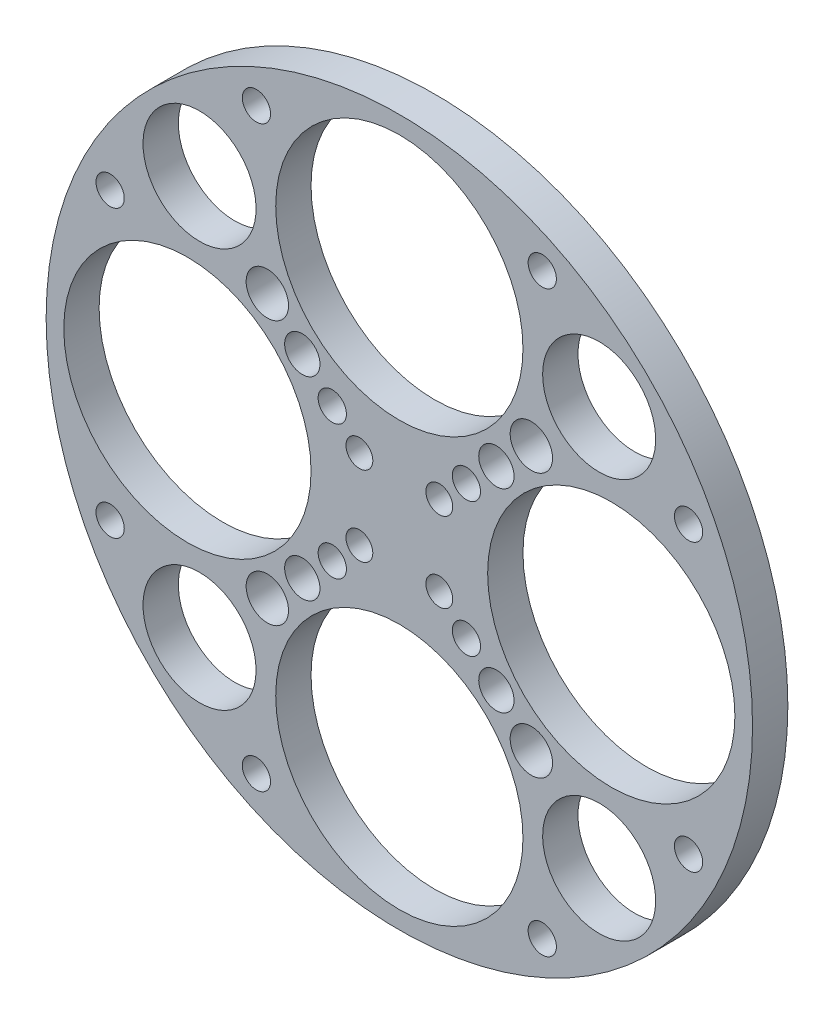
ISO-10303-21;
HEADER;
FILE_DESCRIPTION(('STEP AP214'),'2;1');
FILE_NAME('part.step','',(''),(''),'','','');
FILE_SCHEMA(('AUTOMOTIVE_DESIGN { 1 0 10303 214 1 1 1 1 }'));
ENDSEC;
DATA;
#1=APPLICATION_CONTEXT('core data for automotive mechanical design processes');
#2=APPLICATION_PROTOCOL_DEFINITION('international standard','automotive_design',2000,#1);
#3=PRODUCT_CONTEXT('',#1,'mechanical');
#4=PRODUCT('Part','Part','',(#3));
#5=PRODUCT_RELATED_PRODUCT_CATEGORY('part','',(#4));
#6=PRODUCT_DEFINITION_FORMATION('','',#4);
#7=PRODUCT_DEFINITION_CONTEXT('part definition',#1,'design');
#8=PRODUCT_DEFINITION('design','',#6,#7);
#9=PRODUCT_DEFINITION_SHAPE('','',#8);
#10=(LENGTH_UNIT() NAMED_UNIT(*) SI_UNIT(.MILLI.,.METRE.));
#11=(NAMED_UNIT(*) PLANE_ANGLE_UNIT() SI_UNIT($,.RADIAN.));
#12=(NAMED_UNIT(*) SI_UNIT($,.STERADIAN.) SOLID_ANGLE_UNIT());
#13=UNCERTAINTY_MEASURE_WITH_UNIT(LENGTH_MEASURE(1.E-05),#10,'distance_accuracy_value','');
#14=(GEOMETRIC_REPRESENTATION_CONTEXT(3) GLOBAL_UNCERTAINTY_ASSIGNED_CONTEXT((#13)) GLOBAL_UNIT_ASSIGNED_CONTEXT((#10,
#11,#12)) REPRESENTATION_CONTEXT('',''));
#15=CARTESIAN_POINT('',(0.,0.,0.));
#16=DIRECTION('',(0.,0.,1.));
#17=DIRECTION('',(1.,0.,0.));
#18=AXIS2_PLACEMENT_3D('',#15,#16,#17);
#19=CARTESIAN_POINT('',(0.,0.,5.));
#20=DIRECTION('',(0.,0.,-1.));
#21=DIRECTION('',(-1.,0.,0.));
#22=AXIS2_PLACEMENT_3D('',#19,#20,#21);
#23=CYLINDRICAL_SURFACE('',#22,50.);
#24=CARTESIAN_POINT('',(0.,0.,5.));
#25=DIRECTION('',(0.,0.,1.));
#26=DIRECTION('',(1.,0.,0.));
#27=AXIS2_PLACEMENT_3D('',#24,#25,#26);
#28=CIRCLE('',#27,50.);
#29=CARTESIAN_POINT('',(50.,0.,5.));
#30=VERTEX_POINT('',#29);
#31=EDGE_CURVE('E10',#30,#30,#28,.T.);
#32=ORIENTED_EDGE('',*,*,#31,.F.);
#33=EDGE_LOOP('',(#32));
#34=FACE_BOUND('',#33,.T.);
#35=CARTESIAN_POINT('',(0.,0.,0.));
#36=DIRECTION('',(0.,0.,1.));
#37=DIRECTION('',(1.,0.,0.));
#38=AXIS2_PLACEMENT_3D('',#35,#36,#37);
#39=CIRCLE('',#38,50.);
#40=CARTESIAN_POINT('',(50.,0.,0.));
#41=VERTEX_POINT('',#40);
#42=EDGE_CURVE('E33',#41,#41,#39,.T.);
#43=ORIENTED_EDGE('',*,*,#42,.T.);
#44=EDGE_LOOP('',(#43));
#45=FACE_BOUND('',#44,.T.);
#46=ADVANCED_FACE('F30',(#34,#45),#23,.T.);
#47=CARTESIAN_POINT('',(0.,0.,5.));
#48=DIRECTION('',(0.,0.,1.));
#49=DIRECTION('',(1.,0.,0.));
#50=AXIS2_PLACEMENT_3D('',#47,#48,#49);
#51=PLANE('',#50);
#52=CARTESIAN_POINT('',(-20.2317836088397,40.9396038321809,5.));
#53=DIRECTION('',(0.,0.,-1.));
#54=DIRECTION('',(0.,-1.,0.));
#55=AXIS2_PLACEMENT_3D('',#52,#53,#54);
#56=CIRCLE('',#55,2.);
#57=CARTESIAN_POINT('',(-20.2317836088398,38.9396038321809,5.));
#58=VERTEX_POINT('',#57);
#59=EDGE_CURVE('E225',#58,#58,#56,.T.);
#60=ORIENTED_EDGE('',*,*,#59,.T.);
#61=EDGE_LOOP('',(#60));
#62=FACE_BOUND('',#61,.T.);
#63=CARTESIAN_POINT('',(-40.9396038321805,20.2317836088407,5.));
#64=DIRECTION('',(0.,0.,-1.));
#65=DIRECTION('',(0.,-1.,0.));
#66=AXIS2_PLACEMENT_3D('',#63,#64,#65);
#67=CIRCLE('',#66,2.);
#68=CARTESIAN_POINT('',(-40.9396038321805,18.2317836088407,5.));
#69=VERTEX_POINT('',#68);
#70=EDGE_CURVE('E219',#69,#69,#67,.T.);
#71=ORIENTED_EDGE('',*,*,#70,.T.);
#72=EDGE_LOOP('',(#71));
#73=FACE_BOUND('',#72,.T.);
#74=CARTESIAN_POINT('',(-9.49390334559002,9.49390334559022,5.));
#75=DIRECTION('',(0.,0.,-1.));
#76=DIRECTION('',(0.,-1.,0.));
#77=AXIS2_PLACEMENT_3D('',#74,#75,#76);
#78=CIRCLE('',#77,2.);
#79=CARTESIAN_POINT('',(-9.49390334559004,7.49390334559022,5.));
#80=VERTEX_POINT('',#79);
#81=EDGE_CURVE('E213',#80,#80,#78,.T.);
#82=ORIENTED_EDGE('',*,*,#81,.T.);
#83=EDGE_LOOP('',(#82));
#84=FACE_BOUND('',#83,.T.);
#85=CARTESIAN_POINT('',(-13.7365440327093,13.7365440327096,5.));
#86=DIRECTION('',(0.,0.,-1.));
#87=DIRECTION('',(0.,-1.,0.));
#88=AXIS2_PLACEMENT_3D('',#85,#86,#87);
#89=CIRCLE('',#88,2.5);
#90=CARTESIAN_POINT('',(-13.7365440327093,11.2365440327096,5.));
#91=VERTEX_POINT('',#90);
#92=EDGE_CURVE('E207',#91,#91,#89,.T.);
#93=ORIENTED_EDGE('',*,*,#92,.T.);
#94=EDGE_LOOP('',(#93));
#95=FACE_BOUND('',#94,.T.);
#96=CARTESIAN_POINT('',(-18.686291501015,18.6862915010154,5.));
#97=DIRECTION('',(0.,0.,-1.));
#98=DIRECTION('',(0.,-1.,0.));
#99=AXIS2_PLACEMENT_3D('',#96,#97,#98);
#100=CIRCLE('',#99,2.99999999999999);
#101=CARTESIAN_POINT('',(-18.6862915010151,15.6862915010154,5.));
#102=VERTEX_POINT('',#101);
#103=EDGE_CURVE('E201',#102,#102,#100,.T.);
#104=ORIENTED_EDGE('',*,*,#103,.T.);
#105=EDGE_LOOP('',(#104));
#106=FACE_BOUND('',#105,.T.);
#107=CARTESIAN_POINT('',(-28.2842712474616,28.2842712474622,5.));
#108=DIRECTION('',(0.,0.,-1.));
#109=DIRECTION('',(0.,-1.,0.));
#110=AXIS2_PLACEMENT_3D('',#107,#108,#109);
#111=CIRCLE('',#110,8.);
#112=CARTESIAN_POINT('',(-28.2842712474617,20.2842712474622,5.));
#113=VERTEX_POINT('',#112);
#114=EDGE_CURVE('E195',#113,#113,#111,.T.);
#115=ORIENTED_EDGE('',*,*,#114,.T.);
#116=EDGE_LOOP('',(#115));
#117=FACE_BOUND('',#116,.T.);
#118=CARTESIAN_POINT('',(-40.9396038321807,-20.2317836088402,5.));
#119=DIRECTION('',(0.,0.,-1.));
#120=DIRECTION('',(1.,0.,0.));
#121=AXIS2_PLACEMENT_3D('',#118,#119,#120);
#122=CIRCLE('',#121,2.);
#123=CARTESIAN_POINT('',(-38.9396038321807,-20.2317836088402,5.));
#124=VERTEX_POINT('',#123);
#125=EDGE_CURVE('E189',#124,#124,#122,.T.);
#126=ORIENTED_EDGE('',*,*,#125,.T.);
#127=EDGE_LOOP('',(#126));
#128=FACE_BOUND('',#127,.T.);
#129=CARTESIAN_POINT('',(-20.2317836088403,-40.9396038321807,5.));
#130=DIRECTION('',(0.,0.,-1.));
#131=DIRECTION('',(1.,0.,0.));
#132=AXIS2_PLACEMENT_3D('',#129,#130,#131);
#133=CIRCLE('',#132,2.);
#134=CARTESIAN_POINT('',(-18.2317836088403,-40.9396038321807,5.));
#135=VERTEX_POINT('',#134);
#136=EDGE_CURVE('E183',#135,#135,#133,.T.);
#137=ORIENTED_EDGE('',*,*,#136,.T.);
#138=EDGE_LOOP('',(#137));
#139=FACE_BOUND('',#138,.T.);
#140=CARTESIAN_POINT('',(-9.49390334559012,-9.49390334559012,5.));
#141=DIRECTION('',(0.,0.,-1.));
#142=DIRECTION('',(1.,0.,0.));
#143=AXIS2_PLACEMENT_3D('',#140,#141,#142);
#144=CIRCLE('',#143,2.);
#145=CARTESIAN_POINT('',(-7.49390334559012,-9.49390334559012,5.));
#146=VERTEX_POINT('',#145);
#147=EDGE_CURVE('E177',#146,#146,#144,.T.);
#148=ORIENTED_EDGE('',*,*,#147,.T.);
#149=EDGE_LOOP('',(#148));
#150=FACE_BOUND('',#149,.T.);
#151=CARTESIAN_POINT('',(-13.7365440327094,-13.7365440327094,5.));
#152=DIRECTION('',(0.,0.,-1.));
#153=DIRECTION('',(1.,0.,0.));
#154=AXIS2_PLACEMENT_3D('',#151,#152,#153);
#155=CIRCLE('',#154,2.5);
#156=CARTESIAN_POINT('',(-11.2365440327094,-13.7365440327094,5.));
#157=VERTEX_POINT('',#156);
#158=EDGE_CURVE('E171',#157,#157,#155,.T.);
#159=ORIENTED_EDGE('',*,*,#158,.T.);
#160=EDGE_LOOP('',(#159));
#161=FACE_BOUND('',#160,.T.);
#162=CARTESIAN_POINT('',(-18.6862915010152,-18.6862915010152,5.));
#163=DIRECTION('',(0.,0.,-1.));
#164=DIRECTION('',(1.,0.,0.));
#165=AXIS2_PLACEMENT_3D('',#162,#163,#164);
#166=CIRCLE('',#165,2.99999999999999);
#167=CARTESIAN_POINT('',(-15.6862915010152,-18.6862915010152,5.));
#168=VERTEX_POINT('',#167);
#169=EDGE_CURVE('E165',#168,#168,#166,.T.);
#170=ORIENTED_EDGE('',*,*,#169,.T.);
#171=EDGE_LOOP('',(#170));
#172=FACE_BOUND('',#171,.T.);
#173=CARTESIAN_POINT('',(-28.2842712474619,-28.2842712474619,5.));
#174=DIRECTION('',(0.,0.,-1.));
#175=DIRECTION('',(1.,0.,0.));
#176=AXIS2_PLACEMENT_3D('',#173,#174,#175);
#177=CIRCLE('',#176,8.);
#178=CARTESIAN_POINT('',(-20.2842712474619,-28.2842712474619,5.));
#179=VERTEX_POINT('',#178);
#180=EDGE_CURVE('E159',#179,#179,#177,.T.);
#181=ORIENTED_EDGE('',*,*,#180,.T.);
#182=EDGE_LOOP('',(#181));
#183=FACE_BOUND('',#182,.T.);
#184=CARTESIAN_POINT('',(20.23178360884,-40.9396038321807,5.));
#185=DIRECTION('',(0.,0.,-1.));
#186=DIRECTION('',(0.,1.,0.));
#187=AXIS2_PLACEMENT_3D('',#184,#185,#186);
#188=CIRCLE('',#187,2.);
#189=CARTESIAN_POINT('',(20.23178360884,-38.9396038321807,5.));
#190=VERTEX_POINT('',#189);
#191=EDGE_CURVE('E153',#190,#190,#188,.T.);
#192=ORIENTED_EDGE('',*,*,#191,.T.);
#193=EDGE_LOOP('',(#192));
#194=FACE_BOUND('',#193,.T.);
#195=CARTESIAN_POINT('',(40.9396038321806,-20.2317836088404,5.));
#196=DIRECTION('',(0.,0.,-1.));
#197=DIRECTION('',(0.,1.,0.));
#198=AXIS2_PLACEMENT_3D('',#195,#196,#197);
#199=CIRCLE('',#198,2.);
#200=CARTESIAN_POINT('',(40.9396038321806,-18.2317836088404,5.));
#201=VERTEX_POINT('',#200);
#202=EDGE_CURVE('E147',#201,#201,#199,.T.);
#203=ORIENTED_EDGE('',*,*,#202,.T.);
#204=EDGE_LOOP('',(#203));
#205=FACE_BOUND('',#204,.T.);
#206=CARTESIAN_POINT('',(9.49390334559009,-9.49390334559015,5.));
#207=DIRECTION('',(0.,0.,-1.));
#208=DIRECTION('',(0.,1.,0.));
#209=AXIS2_PLACEMENT_3D('',#206,#207,#208);
#210=CIRCLE('',#209,2.);
#211=CARTESIAN_POINT('',(9.49390334559009,-7.49390334559015,5.));
#212=VERTEX_POINT('',#211);
#213=EDGE_CURVE('E141',#212,#212,#210,.T.);
#214=ORIENTED_EDGE('',*,*,#213,.T.);
#215=EDGE_LOOP('',(#214));
#216=FACE_BOUND('',#215,.T.);
#217=CARTESIAN_POINT('',(13.7365440327094,-13.7365440327095,5.));
#218=DIRECTION('',(0.,0.,-1.));
#219=DIRECTION('',(0.,1.,0.));
#220=AXIS2_PLACEMENT_3D('',#217,#218,#219);
#221=CIRCLE('',#220,2.5);
#222=CARTESIAN_POINT('',(13.7365440327094,-11.2365440327095,5.));
#223=VERTEX_POINT('',#222);
#224=EDGE_CURVE('E135',#223,#223,#221,.T.);
#225=ORIENTED_EDGE('',*,*,#224,.T.);
#226=EDGE_LOOP('',(#225));
#227=FACE_BOUND('',#226,.T.);
#228=CARTESIAN_POINT('',(18.6862915010152,-18.6862915010153,5.));
#229=DIRECTION('',(0.,0.,-1.));
#230=DIRECTION('',(0.,1.,0.));
#231=AXIS2_PLACEMENT_3D('',#228,#229,#230);
#232=CIRCLE('',#231,2.99999999999999);
#233=CARTESIAN_POINT('',(18.6862915010152,-15.6862915010153,5.));
#234=VERTEX_POINT('',#233);
#235=EDGE_CURVE('E129',#234,#234,#232,.T.);
#236=ORIENTED_EDGE('',*,*,#235,.T.);
#237=EDGE_LOOP('',(#236));
#238=FACE_BOUND('',#237,.T.);
#239=CARTESIAN_POINT('',(28.2842712474618,-28.284271247462,5.));
#240=DIRECTION('',(0.,0.,-1.));
#241=DIRECTION('',(0.,1.,0.));
#242=AXIS2_PLACEMENT_3D('',#239,#240,#241);
#243=CIRCLE('',#242,8.);
#244=CARTESIAN_POINT('',(28.2842712474618,-20.284271247462,5.));
#245=VERTEX_POINT('',#244);
#246=EDGE_CURVE('E123',#245,#245,#243,.T.);
#247=ORIENTED_EDGE('',*,*,#246,.T.);
#248=EDGE_LOOP('',(#247));
#249=FACE_BOUND('',#248,.T.);
#250=CARTESIAN_POINT('',(40.9396038321807,20.2317836088402,5.));
#251=DIRECTION('',(0.,0.,-1.));
#252=DIRECTION('',(-1.,0.,0.));
#253=AXIS2_PLACEMENT_3D('',#250,#251,#252);
#254=CIRCLE('',#253,2.);
#255=CARTESIAN_POINT('',(38.9396038321807,20.2317836088402,5.));
#256=VERTEX_POINT('',#255);
#257=EDGE_CURVE('E117',#256,#256,#254,.T.);
#258=ORIENTED_EDGE('',*,*,#257,.T.);
#259=EDGE_LOOP('',(#258));
#260=FACE_BOUND('',#259,.T.);
#261=CARTESIAN_POINT('',(20.2317836088403,40.9396038321807,5.));
#262=DIRECTION('',(0.,0.,-1.));
#263=DIRECTION('',(-1.,0.,0.));
#264=AXIS2_PLACEMENT_3D('',#261,#262,#263);
#265=CIRCLE('',#264,2.);
#266=CARTESIAN_POINT('',(18.2317836088403,40.9396038321807,5.));
#267=VERTEX_POINT('',#266);
#268=EDGE_CURVE('E111',#267,#267,#265,.T.);
#269=ORIENTED_EDGE('',*,*,#268,.T.);
#270=EDGE_LOOP('',(#269));
#271=FACE_BOUND('',#270,.T.);
#272=CARTESIAN_POINT('',(9.49390334559012,9.49390334559012,5.));
#273=DIRECTION('',(0.,0.,-1.));
#274=DIRECTION('',(-1.,0.,0.));
#275=AXIS2_PLACEMENT_3D('',#272,#273,#274);
#276=CIRCLE('',#275,2.);
#277=CARTESIAN_POINT('',(7.49390334559012,9.49390334559012,5.));
#278=VERTEX_POINT('',#277);
#279=EDGE_CURVE('E105',#278,#278,#276,.T.);
#280=ORIENTED_EDGE('',*,*,#279,.T.);
#281=EDGE_LOOP('',(#280));
#282=FACE_BOUND('',#281,.T.);
#283=CARTESIAN_POINT('',(13.7365440327094,13.7365440327094,5.));
#284=DIRECTION('',(0.,0.,-1.));
#285=DIRECTION('',(-1.,0.,0.));
#286=AXIS2_PLACEMENT_3D('',#283,#284,#285);
#287=CIRCLE('',#286,2.5);
#288=CARTESIAN_POINT('',(11.2365440327094,13.7365440327094,5.));
#289=VERTEX_POINT('',#288);
#290=EDGE_CURVE('E99',#289,#289,#287,.T.);
#291=ORIENTED_EDGE('',*,*,#290,.T.);
#292=EDGE_LOOP('',(#291));
#293=FACE_BOUND('',#292,.T.);
#294=CARTESIAN_POINT('',(18.6862915010152,18.6862915010152,5.));
#295=DIRECTION('',(0.,0.,-1.));
#296=DIRECTION('',(-1.,0.,0.));
#297=AXIS2_PLACEMENT_3D('',#294,#295,#296);
#298=CIRCLE('',#297,2.99999999999999);
#299=CARTESIAN_POINT('',(15.6862915010152,18.6862915010152,5.));
#300=VERTEX_POINT('',#299);
#301=EDGE_CURVE('E93',#300,#300,#298,.T.);
#302=ORIENTED_EDGE('',*,*,#301,.T.);
#303=EDGE_LOOP('',(#302));
#304=FACE_BOUND('',#303,.T.);
#305=CARTESIAN_POINT('',(28.2842712474619,28.2842712474619,5.));
#306=DIRECTION('',(0.,0.,-1.));
#307=DIRECTION('',(-1.,0.,0.));
#308=AXIS2_PLACEMENT_3D('',#305,#306,#307);
#309=CIRCLE('',#308,8.);
#310=CARTESIAN_POINT('',(20.2842712474619,28.2842712474619,5.));
#311=VERTEX_POINT('',#310);
#312=EDGE_CURVE('E87',#311,#311,#309,.T.);
#313=ORIENTED_EDGE('',*,*,#312,.T.);
#314=EDGE_LOOP('',(#313));
#315=FACE_BOUND('',#314,.T.);
#316=CARTESIAN_POINT('',(-30.,3.14233320495882E-13,5.));
#317=DIRECTION('',(0.,0.,-1.));
#318=DIRECTION('',(0.,-1.,0.));
#319=AXIS2_PLACEMENT_3D('',#316,#317,#318);
#320=CIRCLE('',#319,17.5);
#321=CARTESIAN_POINT('',(-30.0000000000002,-17.4999999999997,5.));
#322=VERTEX_POINT('',#321);
#323=EDGE_CURVE('E81',#322,#322,#320,.T.);
#324=ORIENTED_EDGE('',*,*,#323,.T.);
#325=EDGE_LOOP('',(#324));
#326=FACE_BOUND('',#325,.T.);
#327=CARTESIAN_POINT('',(0.,-30.,5.));
#328=DIRECTION('',(0.,0.,-1.));
#329=DIRECTION('',(1.,0.,0.));
#330=AXIS2_PLACEMENT_3D('',#327,#328,#329);
#331=CIRCLE('',#330,17.5);
#332=CARTESIAN_POINT('',(17.5,-30.,5.));
#333=VERTEX_POINT('',#332);
#334=EDGE_CURVE('E75',#333,#333,#331,.T.);
#335=ORIENTED_EDGE('',*,*,#334,.T.);
#336=EDGE_LOOP('',(#335));
#337=FACE_BOUND('',#336,.T.);
#338=CARTESIAN_POINT('',(30.,-1.04744440165294E-13,5.));
#339=DIRECTION('',(0.,0.,-1.));
#340=DIRECTION('',(0.,1.,0.));
#341=AXIS2_PLACEMENT_3D('',#338,#339,#340);
#342=CIRCLE('',#341,17.5);
#343=CARTESIAN_POINT('',(30.0000000000001,17.4999999999999,5.));
#344=VERTEX_POINT('',#343);
#345=EDGE_CURVE('E69',#344,#344,#342,.T.);
#346=ORIENTED_EDGE('',*,*,#345,.T.);
#347=EDGE_LOOP('',(#346));
#348=FACE_BOUND('',#347,.T.);
#349=CARTESIAN_POINT('',(0.,30.,5.));
#350=DIRECTION('',(0.,0.,-1.));
#351=DIRECTION('',(-1.,0.,0.));
#352=AXIS2_PLACEMENT_3D('',#349,#350,#351);
#353=CIRCLE('',#352,17.5);
#354=CARTESIAN_POINT('',(-17.5,30.,5.));
#355=VERTEX_POINT('',#354);
#356=EDGE_CURVE('E63',#355,#355,#353,.T.);
#357=ORIENTED_EDGE('',*,*,#356,.T.);
#358=EDGE_LOOP('',(#357));
#359=FACE_BOUND('',#358,.T.);
#360=CARTESIAN_POINT('',(-5.65685424949235,5.65685424949241,5.));
#361=DIRECTION('',(0.,0.,-1.));
#362=DIRECTION('',(0.,-1.,0.));
#363=AXIS2_PLACEMENT_3D('',#360,#361,#362);
#364=CIRCLE('',#363,1.9);
#365=CARTESIAN_POINT('',(-5.65685424949237,3.75685424949241,5.));
#366=VERTEX_POINT('',#365);
#367=EDGE_CURVE('E57',#366,#366,#364,.T.);
#368=ORIENTED_EDGE('',*,*,#367,.T.);
#369=EDGE_LOOP('',(#368));
#370=FACE_BOUND('',#369,.T.);
#371=CARTESIAN_POINT('',(-5.65685424949235,-5.65685424949241,5.));
#372=DIRECTION('',(0.,0.,-1.));
#373=DIRECTION('',(1.,0.,0.));
#374=AXIS2_PLACEMENT_3D('',#371,#372,#373);
#375=CIRCLE('',#374,1.9);
#376=CARTESIAN_POINT('',(-3.75685424949235,-5.65685424949241,5.));
#377=VERTEX_POINT('',#376);
#378=EDGE_CURVE('E51',#377,#377,#375,.T.);
#379=ORIENTED_EDGE('',*,*,#378,.T.);
#380=EDGE_LOOP('',(#379));
#381=FACE_BOUND('',#380,.T.);
#382=CARTESIAN_POINT('',(5.65685424949239,-5.65685424949237,5.));
#383=DIRECTION('',(0.,0.,-1.));
#384=DIRECTION('',(0.,1.,0.));
#385=AXIS2_PLACEMENT_3D('',#382,#383,#384);
#386=CIRCLE('',#385,1.9);
#387=CARTESIAN_POINT('',(5.6568542494924,-3.75685424949237,5.));
#388=VERTEX_POINT('',#387);
#389=EDGE_CURVE('E45',#388,#388,#386,.T.);
#390=ORIENTED_EDGE('',*,*,#389,.T.);
#391=EDGE_LOOP('',(#390));
#392=FACE_BOUND('',#391,.T.);
#393=CARTESIAN_POINT('',(5.65685424949235,5.65685424949241,5.));
#394=DIRECTION('',(0.,0.,-1.));
#395=DIRECTION('',(-1.,0.,0.));
#396=AXIS2_PLACEMENT_3D('',#393,#394,#395);
#397=CIRCLE('',#396,1.9);
#398=CARTESIAN_POINT('',(3.75685424949235,5.65685424949241,5.));
#399=VERTEX_POINT('',#398);
#400=EDGE_CURVE('E40',#399,#399,#397,.T.);
#401=ORIENTED_EDGE('',*,*,#400,.T.);
#402=EDGE_LOOP('',(#401));
#403=FACE_BOUND('',#402,.T.);
#404=ORIENTED_EDGE('',*,*,#31,.T.);
#405=EDGE_LOOP('',(#404));
#406=FACE_BOUND('',#405,.T.);
#407=ADVANCED_FACE('F234',(#62,#73,#84,#95,#106,#117,#128,#139,#150,#161,#172,#183,#194,#205,
#216,#227,#238,#249,#260,#271,#282,#293,#304,#315,#326,#337,#348,#359,#370,#381,#392,#403,#406),
#51,.T.);
#408=CARTESIAN_POINT('',(0.,0.,0.));
#409=DIRECTION('',(0.,0.,1.));
#410=DIRECTION('',(1.,0.,0.));
#411=AXIS2_PLACEMENT_3D('',#408,#409,#410);
#412=PLANE('',#411);
#413=CARTESIAN_POINT('',(-20.2317836088397,40.9396038321809,0.));
#414=DIRECTION('',(0.,0.,-1.));
#415=DIRECTION('',(0.,-1.,0.));
#416=AXIS2_PLACEMENT_3D('',#413,#414,#415);
#417=CIRCLE('',#416,2.);
#418=CARTESIAN_POINT('',(-20.2317836088398,38.9396038321809,0.));
#419=VERTEX_POINT('',#418);
#420=EDGE_CURVE('E228',#419,#419,#417,.T.);
#421=ORIENTED_EDGE('',*,*,#420,.F.);
#422=EDGE_LOOP('',(#421));
#423=FACE_BOUND('',#422,.T.);
#424=CARTESIAN_POINT('',(-40.9396038321805,20.2317836088407,0.));
#425=DIRECTION('',(0.,0.,-1.));
#426=DIRECTION('',(0.,-1.,0.));
#427=AXIS2_PLACEMENT_3D('',#424,#425,#426);
#428=CIRCLE('',#427,2.);
#429=CARTESIAN_POINT('',(-40.9396038321805,18.2317836088407,0.));
#430=VERTEX_POINT('',#429);
#431=EDGE_CURVE('E222',#430,#430,#428,.T.);
#432=ORIENTED_EDGE('',*,*,#431,.F.);
#433=EDGE_LOOP('',(#432));
#434=FACE_BOUND('',#433,.T.);
#435=CARTESIAN_POINT('',(-9.49390334559002,9.49390334559022,0.));
#436=DIRECTION('',(0.,0.,-1.));
#437=DIRECTION('',(0.,-1.,0.));
#438=AXIS2_PLACEMENT_3D('',#435,#436,#437);
#439=CIRCLE('',#438,2.);
#440=CARTESIAN_POINT('',(-9.49390334559004,7.49390334559022,0.));
#441=VERTEX_POINT('',#440);
#442=EDGE_CURVE('E216',#441,#441,#439,.T.);
#443=ORIENTED_EDGE('',*,*,#442,.F.);
#444=EDGE_LOOP('',(#443));
#445=FACE_BOUND('',#444,.T.);
#446=CARTESIAN_POINT('',(-13.7365440327093,13.7365440327096,0.));
#447=DIRECTION('',(0.,0.,-1.));
#448=DIRECTION('',(0.,-1.,0.));
#449=AXIS2_PLACEMENT_3D('',#446,#447,#448);
#450=CIRCLE('',#449,2.5);
#451=CARTESIAN_POINT('',(-13.7365440327093,11.2365440327096,0.));
#452=VERTEX_POINT('',#451);
#453=EDGE_CURVE('E210',#452,#452,#450,.T.);
#454=ORIENTED_EDGE('',*,*,#453,.F.);
#455=EDGE_LOOP('',(#454));
#456=FACE_BOUND('',#455,.T.);
#457=CARTESIAN_POINT('',(-18.686291501015,18.6862915010154,0.));
#458=DIRECTION('',(0.,0.,-1.));
#459=DIRECTION('',(0.,-1.,0.));
#460=AXIS2_PLACEMENT_3D('',#457,#458,#459);
#461=CIRCLE('',#460,2.99999999999999);
#462=CARTESIAN_POINT('',(-18.6862915010151,15.6862915010154,0.));
#463=VERTEX_POINT('',#462);
#464=EDGE_CURVE('E204',#463,#463,#461,.T.);
#465=ORIENTED_EDGE('',*,*,#464,.F.);
#466=EDGE_LOOP('',(#465));
#467=FACE_BOUND('',#466,.T.);
#468=CARTESIAN_POINT('',(-28.2842712474616,28.2842712474622,0.));
#469=DIRECTION('',(0.,0.,-1.));
#470=DIRECTION('',(0.,-1.,0.));
#471=AXIS2_PLACEMENT_3D('',#468,#469,#470);
#472=CIRCLE('',#471,8.);
#473=CARTESIAN_POINT('',(-28.2842712474617,20.2842712474622,0.));
#474=VERTEX_POINT('',#473);
#475=EDGE_CURVE('E198',#474,#474,#472,.T.);
#476=ORIENTED_EDGE('',*,*,#475,.F.);
#477=EDGE_LOOP('',(#476));
#478=FACE_BOUND('',#477,.T.);
#479=CARTESIAN_POINT('',(-40.9396038321807,-20.2317836088402,0.));
#480=DIRECTION('',(0.,0.,-1.));
#481=DIRECTION('',(1.,0.,0.));
#482=AXIS2_PLACEMENT_3D('',#479,#480,#481);
#483=CIRCLE('',#482,2.);
#484=CARTESIAN_POINT('',(-38.9396038321807,-20.2317836088402,0.));
#485=VERTEX_POINT('',#484);
#486=EDGE_CURVE('E192',#485,#485,#483,.T.);
#487=ORIENTED_EDGE('',*,*,#486,.F.);
#488=EDGE_LOOP('',(#487));
#489=FACE_BOUND('',#488,.T.);
#490=CARTESIAN_POINT('',(-20.2317836088403,-40.9396038321807,0.));
#491=DIRECTION('',(0.,0.,-1.));
#492=DIRECTION('',(1.,0.,0.));
#493=AXIS2_PLACEMENT_3D('',#490,#491,#492);
#494=CIRCLE('',#493,2.);
#495=CARTESIAN_POINT('',(-18.2317836088403,-40.9396038321807,0.));
#496=VERTEX_POINT('',#495);
#497=EDGE_CURVE('E186',#496,#496,#494,.T.);
#498=ORIENTED_EDGE('',*,*,#497,.F.);
#499=EDGE_LOOP('',(#498));
#500=FACE_BOUND('',#499,.T.);
#501=CARTESIAN_POINT('',(-9.49390334559012,-9.49390334559012,0.));
#502=DIRECTION('',(0.,0.,-1.));
#503=DIRECTION('',(1.,0.,0.));
#504=AXIS2_PLACEMENT_3D('',#501,#502,#503);
#505=CIRCLE('',#504,2.);
#506=CARTESIAN_POINT('',(-7.49390334559012,-9.49390334559012,0.));
#507=VERTEX_POINT('',#506);
#508=EDGE_CURVE('E180',#507,#507,#505,.T.);
#509=ORIENTED_EDGE('',*,*,#508,.F.);
#510=EDGE_LOOP('',(#509));
#511=FACE_BOUND('',#510,.T.);
#512=CARTESIAN_POINT('',(-13.7365440327094,-13.7365440327094,0.));
#513=DIRECTION('',(0.,0.,-1.));
#514=DIRECTION('',(1.,0.,0.));
#515=AXIS2_PLACEMENT_3D('',#512,#513,#514);
#516=CIRCLE('',#515,2.5);
#517=CARTESIAN_POINT('',(-11.2365440327094,-13.7365440327094,0.));
#518=VERTEX_POINT('',#517);
#519=EDGE_CURVE('E174',#518,#518,#516,.T.);
#520=ORIENTED_EDGE('',*,*,#519,.F.);
#521=EDGE_LOOP('',(#520));
#522=FACE_BOUND('',#521,.T.);
#523=CARTESIAN_POINT('',(-18.6862915010152,-18.6862915010152,0.));
#524=DIRECTION('',(0.,0.,-1.));
#525=DIRECTION('',(1.,0.,0.));
#526=AXIS2_PLACEMENT_3D('',#523,#524,#525);
#527=CIRCLE('',#526,2.99999999999999);
#528=CARTESIAN_POINT('',(-15.6862915010152,-18.6862915010152,0.));
#529=VERTEX_POINT('',#528);
#530=EDGE_CURVE('E168',#529,#529,#527,.T.);
#531=ORIENTED_EDGE('',*,*,#530,.F.);
#532=EDGE_LOOP('',(#531));
#533=FACE_BOUND('',#532,.T.);
#534=CARTESIAN_POINT('',(-28.2842712474619,-28.2842712474619,0.));
#535=DIRECTION('',(0.,0.,-1.));
#536=DIRECTION('',(1.,0.,0.));
#537=AXIS2_PLACEMENT_3D('',#534,#535,#536);
#538=CIRCLE('',#537,8.);
#539=CARTESIAN_POINT('',(-20.2842712474619,-28.2842712474619,0.));
#540=VERTEX_POINT('',#539);
#541=EDGE_CURVE('E162',#540,#540,#538,.T.);
#542=ORIENTED_EDGE('',*,*,#541,.F.);
#543=EDGE_LOOP('',(#542));
#544=FACE_BOUND('',#543,.T.);
#545=CARTESIAN_POINT('',(20.23178360884,-40.9396038321807,0.));
#546=DIRECTION('',(0.,0.,-1.));
#547=DIRECTION('',(0.,1.,0.));
#548=AXIS2_PLACEMENT_3D('',#545,#546,#547);
#549=CIRCLE('',#548,2.);
#550=CARTESIAN_POINT('',(20.23178360884,-38.9396038321807,0.));
#551=VERTEX_POINT('',#550);
#552=EDGE_CURVE('E156',#551,#551,#549,.T.);
#553=ORIENTED_EDGE('',*,*,#552,.F.);
#554=EDGE_LOOP('',(#553));
#555=FACE_BOUND('',#554,.T.);
#556=CARTESIAN_POINT('',(40.9396038321806,-20.2317836088404,0.));
#557=DIRECTION('',(0.,0.,-1.));
#558=DIRECTION('',(0.,1.,0.));
#559=AXIS2_PLACEMENT_3D('',#556,#557,#558);
#560=CIRCLE('',#559,2.);
#561=CARTESIAN_POINT('',(40.9396038321806,-18.2317836088404,0.));
#562=VERTEX_POINT('',#561);
#563=EDGE_CURVE('E150',#562,#562,#560,.T.);
#564=ORIENTED_EDGE('',*,*,#563,.F.);
#565=EDGE_LOOP('',(#564));
#566=FACE_BOUND('',#565,.T.);
#567=CARTESIAN_POINT('',(9.49390334559009,-9.49390334559015,0.));
#568=DIRECTION('',(0.,0.,-1.));
#569=DIRECTION('',(0.,1.,0.));
#570=AXIS2_PLACEMENT_3D('',#567,#568,#569);
#571=CIRCLE('',#570,2.);
#572=CARTESIAN_POINT('',(9.49390334559009,-7.49390334559015,0.));
#573=VERTEX_POINT('',#572);
#574=EDGE_CURVE('E144',#573,#573,#571,.T.);
#575=ORIENTED_EDGE('',*,*,#574,.F.);
#576=EDGE_LOOP('',(#575));
#577=FACE_BOUND('',#576,.T.);
#578=CARTESIAN_POINT('',(13.7365440327094,-13.7365440327095,0.));
#579=DIRECTION('',(0.,0.,-1.));
#580=DIRECTION('',(0.,1.,0.));
#581=AXIS2_PLACEMENT_3D('',#578,#579,#580);
#582=CIRCLE('',#581,2.5);
#583=CARTESIAN_POINT('',(13.7365440327094,-11.2365440327095,0.));
#584=VERTEX_POINT('',#583);
#585=EDGE_CURVE('E138',#584,#584,#582,.T.);
#586=ORIENTED_EDGE('',*,*,#585,.F.);
#587=EDGE_LOOP('',(#586));
#588=FACE_BOUND('',#587,.T.);
#589=CARTESIAN_POINT('',(18.6862915010152,-18.6862915010153,0.));
#590=DIRECTION('',(0.,0.,-1.));
#591=DIRECTION('',(0.,1.,0.));
#592=AXIS2_PLACEMENT_3D('',#589,#590,#591);
#593=CIRCLE('',#592,2.99999999999999);
#594=CARTESIAN_POINT('',(18.6862915010152,-15.6862915010153,0.));
#595=VERTEX_POINT('',#594);
#596=EDGE_CURVE('E132',#595,#595,#593,.T.);
#597=ORIENTED_EDGE('',*,*,#596,.F.);
#598=EDGE_LOOP('',(#597));
#599=FACE_BOUND('',#598,.T.);
#600=CARTESIAN_POINT('',(28.2842712474618,-28.284271247462,0.));
#601=DIRECTION('',(0.,0.,-1.));
#602=DIRECTION('',(0.,1.,0.));
#603=AXIS2_PLACEMENT_3D('',#600,#601,#602);
#604=CIRCLE('',#603,8.);
#605=CARTESIAN_POINT('',(28.2842712474618,-20.284271247462,0.));
#606=VERTEX_POINT('',#605);
#607=EDGE_CURVE('E126',#606,#606,#604,.T.);
#608=ORIENTED_EDGE('',*,*,#607,.F.);
#609=EDGE_LOOP('',(#608));
#610=FACE_BOUND('',#609,.T.);
#611=CARTESIAN_POINT('',(40.9396038321807,20.2317836088402,0.));
#612=DIRECTION('',(0.,0.,-1.));
#613=DIRECTION('',(-1.,0.,0.));
#614=AXIS2_PLACEMENT_3D('',#611,#612,#613);
#615=CIRCLE('',#614,2.);
#616=CARTESIAN_POINT('',(38.9396038321807,20.2317836088402,0.));
#617=VERTEX_POINT('',#616);
#618=EDGE_CURVE('E120',#617,#617,#615,.T.);
#619=ORIENTED_EDGE('',*,*,#618,.F.);
#620=EDGE_LOOP('',(#619));
#621=FACE_BOUND('',#620,.T.);
#622=CARTESIAN_POINT('',(20.2317836088403,40.9396038321807,0.));
#623=DIRECTION('',(0.,0.,-1.));
#624=DIRECTION('',(-1.,0.,0.));
#625=AXIS2_PLACEMENT_3D('',#622,#623,#624);
#626=CIRCLE('',#625,2.);
#627=CARTESIAN_POINT('',(18.2317836088403,40.9396038321807,0.));
#628=VERTEX_POINT('',#627);
#629=EDGE_CURVE('E114',#628,#628,#626,.T.);
#630=ORIENTED_EDGE('',*,*,#629,.F.);
#631=EDGE_LOOP('',(#630));
#632=FACE_BOUND('',#631,.T.);
#633=CARTESIAN_POINT('',(9.49390334559012,9.49390334559012,0.));
#634=DIRECTION('',(0.,0.,-1.));
#635=DIRECTION('',(-1.,0.,0.));
#636=AXIS2_PLACEMENT_3D('',#633,#634,#635);
#637=CIRCLE('',#636,2.);
#638=CARTESIAN_POINT('',(7.49390334559012,9.49390334559012,0.));
#639=VERTEX_POINT('',#638);
#640=EDGE_CURVE('E108',#639,#639,#637,.T.);
#641=ORIENTED_EDGE('',*,*,#640,.F.);
#642=EDGE_LOOP('',(#641));
#643=FACE_BOUND('',#642,.T.);
#644=CARTESIAN_POINT('',(13.7365440327094,13.7365440327094,0.));
#645=DIRECTION('',(0.,0.,-1.));
#646=DIRECTION('',(-1.,0.,0.));
#647=AXIS2_PLACEMENT_3D('',#644,#645,#646);
#648=CIRCLE('',#647,2.5);
#649=CARTESIAN_POINT('',(11.2365440327094,13.7365440327094,0.));
#650=VERTEX_POINT('',#649);
#651=EDGE_CURVE('E102',#650,#650,#648,.T.);
#652=ORIENTED_EDGE('',*,*,#651,.F.);
#653=EDGE_LOOP('',(#652));
#654=FACE_BOUND('',#653,.T.);
#655=CARTESIAN_POINT('',(18.6862915010152,18.6862915010152,0.));
#656=DIRECTION('',(0.,0.,-1.));
#657=DIRECTION('',(-1.,0.,0.));
#658=AXIS2_PLACEMENT_3D('',#655,#656,#657);
#659=CIRCLE('',#658,2.99999999999999);
#660=CARTESIAN_POINT('',(15.6862915010152,18.6862915010152,0.));
#661=VERTEX_POINT('',#660);
#662=EDGE_CURVE('E96',#661,#661,#659,.T.);
#663=ORIENTED_EDGE('',*,*,#662,.F.);
#664=EDGE_LOOP('',(#663));
#665=FACE_BOUND('',#664,.T.);
#666=CARTESIAN_POINT('',(28.2842712474619,28.2842712474619,0.));
#667=DIRECTION('',(0.,0.,-1.));
#668=DIRECTION('',(-1.,0.,0.));
#669=AXIS2_PLACEMENT_3D('',#666,#667,#668);
#670=CIRCLE('',#669,8.);
#671=CARTESIAN_POINT('',(20.2842712474619,28.2842712474619,0.));
#672=VERTEX_POINT('',#671);
#673=EDGE_CURVE('E90',#672,#672,#670,.T.);
#674=ORIENTED_EDGE('',*,*,#673,.F.);
#675=EDGE_LOOP('',(#674));
#676=FACE_BOUND('',#675,.T.);
#677=CARTESIAN_POINT('',(-30.,3.14233320495882E-13,0.));
#678=DIRECTION('',(0.,0.,-1.));
#679=DIRECTION('',(0.,-1.,0.));
#680=AXIS2_PLACEMENT_3D('',#677,#678,#679);
#681=CIRCLE('',#680,17.5);
#682=CARTESIAN_POINT('',(-30.0000000000002,-17.4999999999997,0.));
#683=VERTEX_POINT('',#682);
#684=EDGE_CURVE('E84',#683,#683,#681,.T.);
#685=ORIENTED_EDGE('',*,*,#684,.F.);
#686=EDGE_LOOP('',(#685));
#687=FACE_BOUND('',#686,.T.);
#688=CARTESIAN_POINT('',(0.,-30.,0.));
#689=DIRECTION('',(0.,0.,-1.));
#690=DIRECTION('',(1.,0.,0.));
#691=AXIS2_PLACEMENT_3D('',#688,#689,#690);
#692=CIRCLE('',#691,17.5);
#693=CARTESIAN_POINT('',(17.5,-30.,0.));
#694=VERTEX_POINT('',#693);
#695=EDGE_CURVE('E78',#694,#694,#692,.T.);
#696=ORIENTED_EDGE('',*,*,#695,.F.);
#697=EDGE_LOOP('',(#696));
#698=FACE_BOUND('',#697,.T.);
#699=CARTESIAN_POINT('',(30.,-1.04744440165294E-13,0.));
#700=DIRECTION('',(0.,0.,-1.));
#701=DIRECTION('',(0.,1.,0.));
#702=AXIS2_PLACEMENT_3D('',#699,#700,#701);
#703=CIRCLE('',#702,17.5);
#704=CARTESIAN_POINT('',(30.0000000000001,17.4999999999999,0.));
#705=VERTEX_POINT('',#704);
#706=EDGE_CURVE('E72',#705,#705,#703,.T.);
#707=ORIENTED_EDGE('',*,*,#706,.F.);
#708=EDGE_LOOP('',(#707));
#709=FACE_BOUND('',#708,.T.);
#710=CARTESIAN_POINT('',(0.,30.,0.));
#711=DIRECTION('',(0.,0.,-1.));
#712=DIRECTION('',(-1.,0.,0.));
#713=AXIS2_PLACEMENT_3D('',#710,#711,#712);
#714=CIRCLE('',#713,17.5);
#715=CARTESIAN_POINT('',(-17.5,30.,0.));
#716=VERTEX_POINT('',#715);
#717=EDGE_CURVE('E66',#716,#716,#714,.T.);
#718=ORIENTED_EDGE('',*,*,#717,.F.);
#719=EDGE_LOOP('',(#718));
#720=FACE_BOUND('',#719,.T.);
#721=CARTESIAN_POINT('',(-5.65685424949235,5.65685424949241,0.));
#722=DIRECTION('',(0.,0.,-1.));
#723=DIRECTION('',(0.,-1.,0.));
#724=AXIS2_PLACEMENT_3D('',#721,#722,#723);
#725=CIRCLE('',#724,1.9);
#726=CARTESIAN_POINT('',(-5.65685424949237,3.75685424949241,0.));
#727=VERTEX_POINT('',#726);
#728=EDGE_CURVE('E60',#727,#727,#725,.T.);
#729=ORIENTED_EDGE('',*,*,#728,.F.);
#730=EDGE_LOOP('',(#729));
#731=FACE_BOUND('',#730,.T.);
#732=CARTESIAN_POINT('',(-5.65685424949235,-5.65685424949241,0.));
#733=DIRECTION('',(0.,0.,-1.));
#734=DIRECTION('',(1.,0.,0.));
#735=AXIS2_PLACEMENT_3D('',#732,#733,#734);
#736=CIRCLE('',#735,1.9);
#737=CARTESIAN_POINT('',(-3.75685424949235,-5.65685424949241,0.));
#738=VERTEX_POINT('',#737);
#739=EDGE_CURVE('E54',#738,#738,#736,.T.);
#740=ORIENTED_EDGE('',*,*,#739,.F.);
#741=EDGE_LOOP('',(#740));
#742=FACE_BOUND('',#741,.T.);
#743=CARTESIAN_POINT('',(5.65685424949239,-5.65685424949237,0.));
#744=DIRECTION('',(0.,0.,-1.));
#745=DIRECTION('',(0.,1.,0.));
#746=AXIS2_PLACEMENT_3D('',#743,#744,#745);
#747=CIRCLE('',#746,1.9);
#748=CARTESIAN_POINT('',(5.6568542494924,-3.75685424949237,0.));
#749=VERTEX_POINT('',#748);
#750=EDGE_CURVE('E48',#749,#749,#747,.T.);
#751=ORIENTED_EDGE('',*,*,#750,.F.);
#752=EDGE_LOOP('',(#751));
#753=FACE_BOUND('',#752,.T.);
#754=CARTESIAN_POINT('',(5.65685424949235,5.65685424949241,0.));
#755=DIRECTION('',(0.,0.,-1.));
#756=DIRECTION('',(-1.,0.,0.));
#757=AXIS2_PLACEMENT_3D('',#754,#755,#756);
#758=CIRCLE('',#757,1.9);
#759=CARTESIAN_POINT('',(3.75685424949235,5.65685424949241,0.));
#760=VERTEX_POINT('',#759);
#761=EDGE_CURVE('E42',#760,#760,#758,.T.);
#762=ORIENTED_EDGE('',*,*,#761,.F.);
#763=EDGE_LOOP('',(#762));
#764=FACE_BOUND('',#763,.T.);
#765=ORIENTED_EDGE('',*,*,#42,.F.);
#766=EDGE_LOOP('',(#765));
#767=FACE_BOUND('',#766,.T.);
#768=ADVANCED_FACE('F244',(#423,#434,#445,#456,#467,#478,#489,#500,#511,#522,#533,#544,#555,
#566,#577,#588,#599,#610,#621,#632,#643,#654,#665,#676,#687,#698,#709,#720,#731,#742,#753,#764,
#767),#412,.F.);
#769=CARTESIAN_POINT('',(5.65685424949235,5.65685424949241,5.));
#770=DIRECTION('',(0.,0.,-1.));
#771=DIRECTION('',(-1.,0.,0.));
#772=AXIS2_PLACEMENT_3D('',#769,#770,#771);
#773=CYLINDRICAL_SURFACE('',#772,1.9);
#774=ORIENTED_EDGE('',*,*,#400,.F.);
#775=EDGE_LOOP('',(#774));
#776=FACE_BOUND('',#775,.T.);
#777=ORIENTED_EDGE('',*,*,#761,.T.);
#778=EDGE_LOOP('',(#777));
#779=FACE_BOUND('',#778,.T.);
#780=ADVANCED_FACE('F247',(#776,#779),#773,.F.);
#781=CARTESIAN_POINT('',(5.65685424949239,-5.65685424949237,5.));
#782=DIRECTION('',(0.,0.,-1.));
#783=DIRECTION('',(-1.,0.,0.));
#784=AXIS2_PLACEMENT_3D('',#781,#782,#783);
#785=CYLINDRICAL_SURFACE('',#784,1.9);
#786=ORIENTED_EDGE('',*,*,#389,.F.);
#787=EDGE_LOOP('',(#786));
#788=FACE_BOUND('',#787,.T.);
#789=ORIENTED_EDGE('',*,*,#750,.T.);
#790=EDGE_LOOP('',(#789));
#791=FACE_BOUND('',#790,.T.);
#792=ADVANCED_FACE('F323',(#788,#791),#785,.F.);
#793=CARTESIAN_POINT('',(-5.65685424949235,-5.65685424949241,5.));
#794=DIRECTION('',(0.,0.,-1.));
#795=DIRECTION('',(-1.,0.,0.));
#796=AXIS2_PLACEMENT_3D('',#793,#794,#795);
#797=CYLINDRICAL_SURFACE('',#796,1.9);
#798=ORIENTED_EDGE('',*,*,#378,.F.);
#799=EDGE_LOOP('',(#798));
#800=FACE_BOUND('',#799,.T.);
#801=ORIENTED_EDGE('',*,*,#739,.T.);
#802=EDGE_LOOP('',(#801));
#803=FACE_BOUND('',#802,.T.);
#804=ADVANCED_FACE('F327',(#800,#803),#797,.F.);
#805=CARTESIAN_POINT('',(-5.65685424949235,5.65685424949241,5.));
#806=DIRECTION('',(0.,0.,-1.));
#807=DIRECTION('',(-1.,0.,0.));
#808=AXIS2_PLACEMENT_3D('',#805,#806,#807);
#809=CYLINDRICAL_SURFACE('',#808,1.9);
#810=ORIENTED_EDGE('',*,*,#367,.F.);
#811=EDGE_LOOP('',(#810));
#812=FACE_BOUND('',#811,.T.);
#813=ORIENTED_EDGE('',*,*,#728,.T.);
#814=EDGE_LOOP('',(#813));
#815=FACE_BOUND('',#814,.T.);
#816=ADVANCED_FACE('F331',(#812,#815),#809,.F.);
#817=CARTESIAN_POINT('',(0.,30.,5.));
#818=DIRECTION('',(0.,0.,-1.));
#819=DIRECTION('',(-1.,0.,0.));
#820=AXIS2_PLACEMENT_3D('',#817,#818,#819);
#821=CYLINDRICAL_SURFACE('',#820,17.5);
#822=ORIENTED_EDGE('',*,*,#356,.F.);
#823=EDGE_LOOP('',(#822));
#824=FACE_BOUND('',#823,.T.);
#825=ORIENTED_EDGE('',*,*,#717,.T.);
#826=EDGE_LOOP('',(#825));
#827=FACE_BOUND('',#826,.T.);
#828=ADVANCED_FACE('F335',(#824,#827),#821,.F.);
#829=CARTESIAN_POINT('',(30.,-1.04744440165294E-13,5.));
#830=DIRECTION('',(0.,0.,-1.));
#831=DIRECTION('',(-1.,0.,0.));
#832=AXIS2_PLACEMENT_3D('',#829,#830,#831);
#833=CYLINDRICAL_SURFACE('',#832,17.5);
#834=ORIENTED_EDGE('',*,*,#345,.F.);
#835=EDGE_LOOP('',(#834));
#836=FACE_BOUND('',#835,.T.);
#837=ORIENTED_EDGE('',*,*,#706,.T.);
#838=EDGE_LOOP('',(#837));
#839=FACE_BOUND('',#838,.T.);
#840=ADVANCED_FACE('F339',(#836,#839),#833,.F.);
#841=CARTESIAN_POINT('',(0.,-30.,5.));
#842=DIRECTION('',(0.,0.,-1.));
#843=DIRECTION('',(-1.,0.,0.));
#844=AXIS2_PLACEMENT_3D('',#841,#842,#843);
#845=CYLINDRICAL_SURFACE('',#844,17.5);
#846=ORIENTED_EDGE('',*,*,#334,.F.);
#847=EDGE_LOOP('',(#846));
#848=FACE_BOUND('',#847,.T.);
#849=ORIENTED_EDGE('',*,*,#695,.T.);
#850=EDGE_LOOP('',(#849));
#851=FACE_BOUND('',#850,.T.);
#852=ADVANCED_FACE('F343',(#848,#851),#845,.F.);
#853=CARTESIAN_POINT('',(-30.,3.14233320495882E-13,5.));
#854=DIRECTION('',(0.,0.,-1.));
#855=DIRECTION('',(-1.,0.,0.));
#856=AXIS2_PLACEMENT_3D('',#853,#854,#855);
#857=CYLINDRICAL_SURFACE('',#856,17.5);
#858=ORIENTED_EDGE('',*,*,#323,.F.);
#859=EDGE_LOOP('',(#858));
#860=FACE_BOUND('',#859,.T.);
#861=ORIENTED_EDGE('',*,*,#684,.T.);
#862=EDGE_LOOP('',(#861));
#863=FACE_BOUND('',#862,.T.);
#864=ADVANCED_FACE('F347',(#860,#863),#857,.F.);
#865=CARTESIAN_POINT('',(28.2842712474619,28.2842712474619,5.));
#866=DIRECTION('',(0.,0.,-1.));
#867=DIRECTION('',(-1.,0.,0.));
#868=AXIS2_PLACEMENT_3D('',#865,#866,#867);
#869=CYLINDRICAL_SURFACE('',#868,8.);
#870=ORIENTED_EDGE('',*,*,#312,.F.);
#871=EDGE_LOOP('',(#870));
#872=FACE_BOUND('',#871,.T.);
#873=ORIENTED_EDGE('',*,*,#673,.T.);
#874=EDGE_LOOP('',(#873));
#875=FACE_BOUND('',#874,.T.);
#876=ADVANCED_FACE('F351',(#872,#875),#869,.F.);
#877=CARTESIAN_POINT('',(18.6862915010152,18.6862915010152,5.));
#878=DIRECTION('',(0.,0.,-1.));
#879=DIRECTION('',(-1.,0.,0.));
#880=AXIS2_PLACEMENT_3D('',#877,#878,#879);
#881=CYLINDRICAL_SURFACE('',#880,2.99999999999999);
#882=ORIENTED_EDGE('',*,*,#301,.F.);
#883=EDGE_LOOP('',(#882));
#884=FACE_BOUND('',#883,.T.);
#885=ORIENTED_EDGE('',*,*,#662,.T.);
#886=EDGE_LOOP('',(#885));
#887=FACE_BOUND('',#886,.T.);
#888=ADVANCED_FACE('F355',(#884,#887),#881,.F.);
#889=CARTESIAN_POINT('',(13.7365440327094,13.7365440327094,5.));
#890=DIRECTION('',(0.,0.,-1.));
#891=DIRECTION('',(-1.,0.,0.));
#892=AXIS2_PLACEMENT_3D('',#889,#890,#891);
#893=CYLINDRICAL_SURFACE('',#892,2.5);
#894=ORIENTED_EDGE('',*,*,#290,.F.);
#895=EDGE_LOOP('',(#894));
#896=FACE_BOUND('',#895,.T.);
#897=ORIENTED_EDGE('',*,*,#651,.T.);
#898=EDGE_LOOP('',(#897));
#899=FACE_BOUND('',#898,.T.);
#900=ADVANCED_FACE('F359',(#896,#899),#893,.F.);
#901=CARTESIAN_POINT('',(9.49390334559012,9.49390334559012,5.));
#902=DIRECTION('',(0.,0.,-1.));
#903=DIRECTION('',(-1.,0.,0.));
#904=AXIS2_PLACEMENT_3D('',#901,#902,#903);
#905=CYLINDRICAL_SURFACE('',#904,2.);
#906=ORIENTED_EDGE('',*,*,#279,.F.);
#907=EDGE_LOOP('',(#906));
#908=FACE_BOUND('',#907,.T.);
#909=ORIENTED_EDGE('',*,*,#640,.T.);
#910=EDGE_LOOP('',(#909));
#911=FACE_BOUND('',#910,.T.);
#912=ADVANCED_FACE('F363',(#908,#911),#905,.F.);
#913=CARTESIAN_POINT('',(20.2317836088403,40.9396038321807,5.));
#914=DIRECTION('',(0.,0.,-1.));
#915=DIRECTION('',(-1.,0.,0.));
#916=AXIS2_PLACEMENT_3D('',#913,#914,#915);
#917=CYLINDRICAL_SURFACE('',#916,2.);
#918=ORIENTED_EDGE('',*,*,#268,.F.);
#919=EDGE_LOOP('',(#918));
#920=FACE_BOUND('',#919,.T.);
#921=ORIENTED_EDGE('',*,*,#629,.T.);
#922=EDGE_LOOP('',(#921));
#923=FACE_BOUND('',#922,.T.);
#924=ADVANCED_FACE('F367',(#920,#923),#917,.F.);
#925=CARTESIAN_POINT('',(40.9396038321807,20.2317836088402,5.));
#926=DIRECTION('',(0.,0.,-1.));
#927=DIRECTION('',(-1.,0.,0.));
#928=AXIS2_PLACEMENT_3D('',#925,#926,#927);
#929=CYLINDRICAL_SURFACE('',#928,2.);
#930=ORIENTED_EDGE('',*,*,#257,.F.);
#931=EDGE_LOOP('',(#930));
#932=FACE_BOUND('',#931,.T.);
#933=ORIENTED_EDGE('',*,*,#618,.T.);
#934=EDGE_LOOP('',(#933));
#935=FACE_BOUND('',#934,.T.);
#936=ADVANCED_FACE('F371',(#932,#935),#929,.F.);
#937=CARTESIAN_POINT('',(28.2842712474618,-28.284271247462,5.));
#938=DIRECTION('',(0.,0.,-1.));
#939=DIRECTION('',(-1.,0.,0.));
#940=AXIS2_PLACEMENT_3D('',#937,#938,#939);
#941=CYLINDRICAL_SURFACE('',#940,8.);
#942=ORIENTED_EDGE('',*,*,#246,.F.);
#943=EDGE_LOOP('',(#942));
#944=FACE_BOUND('',#943,.T.);
#945=ORIENTED_EDGE('',*,*,#607,.T.);
#946=EDGE_LOOP('',(#945));
#947=FACE_BOUND('',#946,.T.);
#948=ADVANCED_FACE('F375',(#944,#947),#941,.F.);
#949=CARTESIAN_POINT('',(18.6862915010152,-18.6862915010153,5.));
#950=DIRECTION('',(0.,0.,-1.));
#951=DIRECTION('',(-1.,0.,0.));
#952=AXIS2_PLACEMENT_3D('',#949,#950,#951);
#953=CYLINDRICAL_SURFACE('',#952,2.99999999999999);
#954=ORIENTED_EDGE('',*,*,#235,.F.);
#955=EDGE_LOOP('',(#954));
#956=FACE_BOUND('',#955,.T.);
#957=ORIENTED_EDGE('',*,*,#596,.T.);
#958=EDGE_LOOP('',(#957));
#959=FACE_BOUND('',#958,.T.);
#960=ADVANCED_FACE('F379',(#956,#959),#953,.F.);
#961=CARTESIAN_POINT('',(13.7365440327094,-13.7365440327095,5.));
#962=DIRECTION('',(0.,0.,-1.));
#963=DIRECTION('',(-1.,0.,0.));
#964=AXIS2_PLACEMENT_3D('',#961,#962,#963);
#965=CYLINDRICAL_SURFACE('',#964,2.5);
#966=ORIENTED_EDGE('',*,*,#224,.F.);
#967=EDGE_LOOP('',(#966));
#968=FACE_BOUND('',#967,.T.);
#969=ORIENTED_EDGE('',*,*,#585,.T.);
#970=EDGE_LOOP('',(#969));
#971=FACE_BOUND('',#970,.T.);
#972=ADVANCED_FACE('F383',(#968,#971),#965,.F.);
#973=CARTESIAN_POINT('',(9.49390334559009,-9.49390334559015,5.));
#974=DIRECTION('',(0.,0.,-1.));
#975=DIRECTION('',(-1.,0.,0.));
#976=AXIS2_PLACEMENT_3D('',#973,#974,#975);
#977=CYLINDRICAL_SURFACE('',#976,2.);
#978=ORIENTED_EDGE('',*,*,#213,.F.);
#979=EDGE_LOOP('',(#978));
#980=FACE_BOUND('',#979,.T.);
#981=ORIENTED_EDGE('',*,*,#574,.T.);
#982=EDGE_LOOP('',(#981));
#983=FACE_BOUND('',#982,.T.);
#984=ADVANCED_FACE('F387',(#980,#983),#977,.F.);
#985=CARTESIAN_POINT('',(40.9396038321806,-20.2317836088404,5.));
#986=DIRECTION('',(0.,0.,-1.));
#987=DIRECTION('',(-1.,0.,0.));
#988=AXIS2_PLACEMENT_3D('',#985,#986,#987);
#989=CYLINDRICAL_SURFACE('',#988,2.);
#990=ORIENTED_EDGE('',*,*,#202,.F.);
#991=EDGE_LOOP('',(#990));
#992=FACE_BOUND('',#991,.T.);
#993=ORIENTED_EDGE('',*,*,#563,.T.);
#994=EDGE_LOOP('',(#993));
#995=FACE_BOUND('',#994,.T.);
#996=ADVANCED_FACE('F391',(#992,#995),#989,.F.);
#997=CARTESIAN_POINT('',(20.23178360884,-40.9396038321807,5.));
#998=DIRECTION('',(0.,0.,-1.));
#999=DIRECTION('',(-1.,0.,0.));
#1000=AXIS2_PLACEMENT_3D('',#997,#998,#999);
#1001=CYLINDRICAL_SURFACE('',#1000,2.);
#1002=ORIENTED_EDGE('',*,*,#191,.F.);
#1003=EDGE_LOOP('',(#1002));
#1004=FACE_BOUND('',#1003,.T.);
#1005=ORIENTED_EDGE('',*,*,#552,.T.);
#1006=EDGE_LOOP('',(#1005));
#1007=FACE_BOUND('',#1006,.T.);
#1008=ADVANCED_FACE('F395',(#1004,#1007),#1001,.F.);
#1009=CARTESIAN_POINT('',(-28.2842712474619,-28.2842712474619,5.));
#1010=DIRECTION('',(0.,0.,-1.));
#1011=DIRECTION('',(-1.,0.,0.));
#1012=AXIS2_PLACEMENT_3D('',#1009,#1010,#1011);
#1013=CYLINDRICAL_SURFACE('',#1012,8.);
#1014=ORIENTED_EDGE('',*,*,#180,.F.);
#1015=EDGE_LOOP('',(#1014));
#1016=FACE_BOUND('',#1015,.T.);
#1017=ORIENTED_EDGE('',*,*,#541,.T.);
#1018=EDGE_LOOP('',(#1017));
#1019=FACE_BOUND('',#1018,.T.);
#1020=ADVANCED_FACE('F399',(#1016,#1019),#1013,.F.);
#1021=CARTESIAN_POINT('',(-18.6862915010152,-18.6862915010152,5.));
#1022=DIRECTION('',(0.,0.,-1.));
#1023=DIRECTION('',(-1.,0.,0.));
#1024=AXIS2_PLACEMENT_3D('',#1021,#1022,#1023);
#1025=CYLINDRICAL_SURFACE('',#1024,2.99999999999999);
#1026=ORIENTED_EDGE('',*,*,#169,.F.);
#1027=EDGE_LOOP('',(#1026));
#1028=FACE_BOUND('',#1027,.T.);
#1029=ORIENTED_EDGE('',*,*,#530,.T.);
#1030=EDGE_LOOP('',(#1029));
#1031=FACE_BOUND('',#1030,.T.);
#1032=ADVANCED_FACE('F403',(#1028,#1031),#1025,.F.);
#1033=CARTESIAN_POINT('',(-13.7365440327094,-13.7365440327094,5.));
#1034=DIRECTION('',(0.,0.,-1.));
#1035=DIRECTION('',(-1.,0.,0.));
#1036=AXIS2_PLACEMENT_3D('',#1033,#1034,#1035);
#1037=CYLINDRICAL_SURFACE('',#1036,2.5);
#1038=ORIENTED_EDGE('',*,*,#158,.F.);
#1039=EDGE_LOOP('',(#1038));
#1040=FACE_BOUND('',#1039,.T.);
#1041=ORIENTED_EDGE('',*,*,#519,.T.);
#1042=EDGE_LOOP('',(#1041));
#1043=FACE_BOUND('',#1042,.T.);
#1044=ADVANCED_FACE('F407',(#1040,#1043),#1037,.F.);
#1045=CARTESIAN_POINT('',(-9.49390334559012,-9.49390334559012,5.));
#1046=DIRECTION('',(0.,0.,-1.));
#1047=DIRECTION('',(-1.,0.,0.));
#1048=AXIS2_PLACEMENT_3D('',#1045,#1046,#1047);
#1049=CYLINDRICAL_SURFACE('',#1048,2.);
#1050=ORIENTED_EDGE('',*,*,#147,.F.);
#1051=EDGE_LOOP('',(#1050));
#1052=FACE_BOUND('',#1051,.T.);
#1053=ORIENTED_EDGE('',*,*,#508,.T.);
#1054=EDGE_LOOP('',(#1053));
#1055=FACE_BOUND('',#1054,.T.);
#1056=ADVANCED_FACE('F411',(#1052,#1055),#1049,.F.);
#1057=CARTESIAN_POINT('',(-20.2317836088403,-40.9396038321807,5.));
#1058=DIRECTION('',(0.,0.,-1.));
#1059=DIRECTION('',(-1.,0.,0.));
#1060=AXIS2_PLACEMENT_3D('',#1057,#1058,#1059);
#1061=CYLINDRICAL_SURFACE('',#1060,2.);
#1062=ORIENTED_EDGE('',*,*,#136,.F.);
#1063=EDGE_LOOP('',(#1062));
#1064=FACE_BOUND('',#1063,.T.);
#1065=ORIENTED_EDGE('',*,*,#497,.T.);
#1066=EDGE_LOOP('',(#1065));
#1067=FACE_BOUND('',#1066,.T.);
#1068=ADVANCED_FACE('F415',(#1064,#1067),#1061,.F.);
#1069=CARTESIAN_POINT('',(-40.9396038321807,-20.2317836088402,5.));
#1070=DIRECTION('',(0.,0.,-1.));
#1071=DIRECTION('',(-1.,0.,0.));
#1072=AXIS2_PLACEMENT_3D('',#1069,#1070,#1071);
#1073=CYLINDRICAL_SURFACE('',#1072,2.);
#1074=ORIENTED_EDGE('',*,*,#125,.F.);
#1075=EDGE_LOOP('',(#1074));
#1076=FACE_BOUND('',#1075,.T.);
#1077=ORIENTED_EDGE('',*,*,#486,.T.);
#1078=EDGE_LOOP('',(#1077));
#1079=FACE_BOUND('',#1078,.T.);
#1080=ADVANCED_FACE('F419',(#1076,#1079),#1073,.F.);
#1081=CARTESIAN_POINT('',(-28.2842712474616,28.2842712474622,5.));
#1082=DIRECTION('',(0.,0.,-1.));
#1083=DIRECTION('',(-1.,0.,0.));
#1084=AXIS2_PLACEMENT_3D('',#1081,#1082,#1083);
#1085=CYLINDRICAL_SURFACE('',#1084,8.);
#1086=ORIENTED_EDGE('',*,*,#114,.F.);
#1087=EDGE_LOOP('',(#1086));
#1088=FACE_BOUND('',#1087,.T.);
#1089=ORIENTED_EDGE('',*,*,#475,.T.);
#1090=EDGE_LOOP('',(#1089));
#1091=FACE_BOUND('',#1090,.T.);
#1092=ADVANCED_FACE('F423',(#1088,#1091),#1085,.F.);
#1093=CARTESIAN_POINT('',(-18.686291501015,18.6862915010154,5.));
#1094=DIRECTION('',(0.,0.,-1.));
#1095=DIRECTION('',(-1.,0.,0.));
#1096=AXIS2_PLACEMENT_3D('',#1093,#1094,#1095);
#1097=CYLINDRICAL_SURFACE('',#1096,2.99999999999999);
#1098=ORIENTED_EDGE('',*,*,#103,.F.);
#1099=EDGE_LOOP('',(#1098));
#1100=FACE_BOUND('',#1099,.T.);
#1101=ORIENTED_EDGE('',*,*,#464,.T.);
#1102=EDGE_LOOP('',(#1101));
#1103=FACE_BOUND('',#1102,.T.);
#1104=ADVANCED_FACE('F427',(#1100,#1103),#1097,.F.);
#1105=CARTESIAN_POINT('',(-13.7365440327093,13.7365440327096,5.));
#1106=DIRECTION('',(0.,0.,-1.));
#1107=DIRECTION('',(-1.,0.,0.));
#1108=AXIS2_PLACEMENT_3D('',#1105,#1106,#1107);
#1109=CYLINDRICAL_SURFACE('',#1108,2.5);
#1110=ORIENTED_EDGE('',*,*,#92,.F.);
#1111=EDGE_LOOP('',(#1110));
#1112=FACE_BOUND('',#1111,.T.);
#1113=ORIENTED_EDGE('',*,*,#453,.T.);
#1114=EDGE_LOOP('',(#1113));
#1115=FACE_BOUND('',#1114,.T.);
#1116=ADVANCED_FACE('F431',(#1112,#1115),#1109,.F.);
#1117=CARTESIAN_POINT('',(-9.49390334559002,9.49390334559022,5.));
#1118=DIRECTION('',(0.,0.,-1.));
#1119=DIRECTION('',(-1.,0.,0.));
#1120=AXIS2_PLACEMENT_3D('',#1117,#1118,#1119);
#1121=CYLINDRICAL_SURFACE('',#1120,2.);
#1122=ORIENTED_EDGE('',*,*,#81,.F.);
#1123=EDGE_LOOP('',(#1122));
#1124=FACE_BOUND('',#1123,.T.);
#1125=ORIENTED_EDGE('',*,*,#442,.T.);
#1126=EDGE_LOOP('',(#1125));
#1127=FACE_BOUND('',#1126,.T.);
#1128=ADVANCED_FACE('F435',(#1124,#1127),#1121,.F.);
#1129=CARTESIAN_POINT('',(-40.9396038321805,20.2317836088407,5.));
#1130=DIRECTION('',(0.,0.,-1.));
#1131=DIRECTION('',(-1.,0.,0.));
#1132=AXIS2_PLACEMENT_3D('',#1129,#1130,#1131);
#1133=CYLINDRICAL_SURFACE('',#1132,2.);
#1134=ORIENTED_EDGE('',*,*,#70,.F.);
#1135=EDGE_LOOP('',(#1134));
#1136=FACE_BOUND('',#1135,.T.);
#1137=ORIENTED_EDGE('',*,*,#431,.T.);
#1138=EDGE_LOOP('',(#1137));
#1139=FACE_BOUND('',#1138,.T.);
#1140=ADVANCED_FACE('F240',(#1136,#1139),#1133,.F.);
#1141=CARTESIAN_POINT('',(-20.2317836088397,40.9396038321809,5.));
#1142=DIRECTION('',(0.,0.,-1.));
#1143=DIRECTION('',(-1.,0.,0.));
#1144=AXIS2_PLACEMENT_3D('',#1141,#1142,#1143);
#1145=CYLINDRICAL_SURFACE('',#1144,2.);
#1146=ORIENTED_EDGE('',*,*,#59,.F.);
#1147=EDGE_LOOP('',(#1146));
#1148=FACE_BOUND('',#1147,.T.);
#1149=ORIENTED_EDGE('',*,*,#420,.T.);
#1150=EDGE_LOOP('',(#1149));
#1151=FACE_BOUND('',#1150,.T.);
#1152=ADVANCED_FACE('F237',(#1148,#1151),#1145,.F.);
#1153=CLOSED_SHELL('',(#46,#407,#768,#780,#792,#804,#816,#828,#840,#852,#864,#876,#888,#900,
#912,#924,#936,#948,#960,#972,#984,#996,#1008,#1020,#1032,#1044,#1056,#1068,#1080,#1092,#1104,
#1116,#1128,#1140,#1152));
#1154=MANIFOLD_SOLID_BREP('B2',#1153);
#1155=ADVANCED_BREP_SHAPE_REPRESENTATION('',(#18,#1154),#14);
#1156=SHAPE_DEFINITION_REPRESENTATION(#9,#1155);
ENDSEC;
END-ISO-10303-21;
